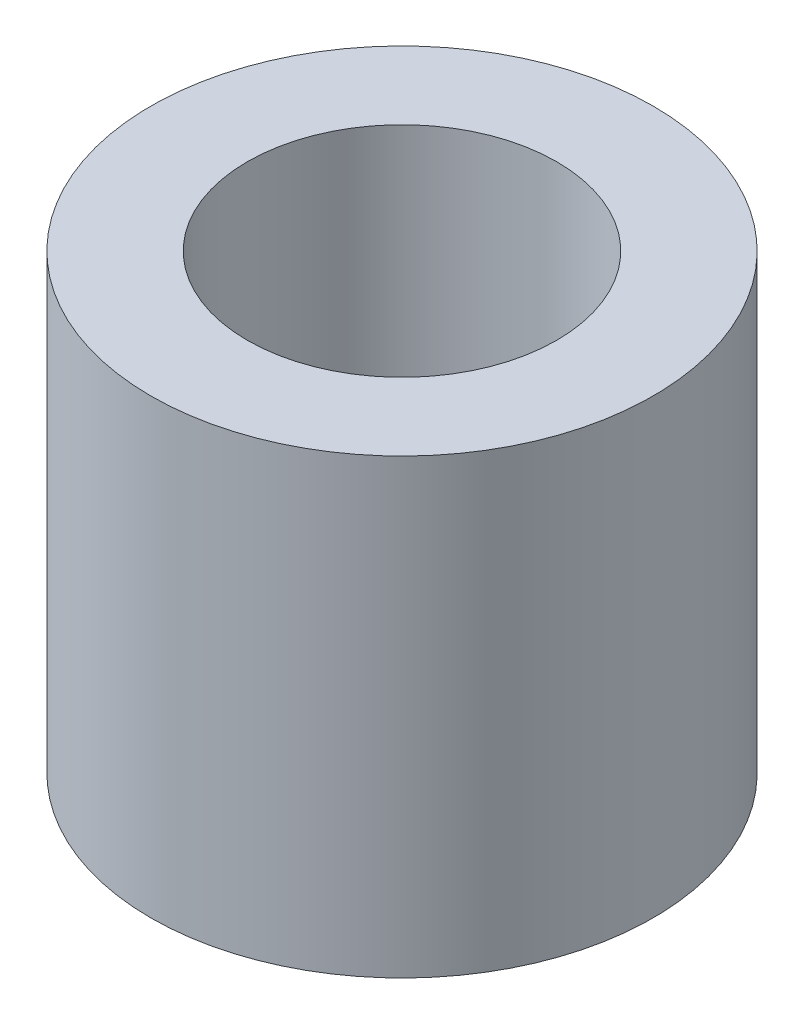
ISO-10303-21;
HEADER;
FILE_DESCRIPTION(('STEP AP214'),'2;1');
FILE_NAME('part.step','',(''),(''),'','','');
FILE_SCHEMA(('AUTOMOTIVE_DESIGN { 1 0 10303 214 1 1 1 1 }'));
ENDSEC;
DATA;
#1=APPLICATION_CONTEXT('core data for automotive mechanical design processes');
#2=APPLICATION_PROTOCOL_DEFINITION('international standard','automotive_design',2000,#1);
#3=PRODUCT_CONTEXT('',#1,'mechanical');
#4=PRODUCT('Part','Part','',(#3));
#5=PRODUCT_RELATED_PRODUCT_CATEGORY('part','',(#4));
#6=PRODUCT_DEFINITION_FORMATION('','',#4);
#7=PRODUCT_DEFINITION_CONTEXT('part definition',#1,'design');
#8=PRODUCT_DEFINITION('design','',#6,#7);
#9=PRODUCT_DEFINITION_SHAPE('','',#8);
#10=(LENGTH_UNIT() NAMED_UNIT(*) SI_UNIT(.MILLI.,.METRE.));
#11=(NAMED_UNIT(*) PLANE_ANGLE_UNIT() SI_UNIT($,.RADIAN.));
#12=(NAMED_UNIT(*) SI_UNIT($,.STERADIAN.) SOLID_ANGLE_UNIT());
#13=UNCERTAINTY_MEASURE_WITH_UNIT(LENGTH_MEASURE(1.E-05),#10,'distance_accuracy_value','');
#14=(GEOMETRIC_REPRESENTATION_CONTEXT(3) GLOBAL_UNCERTAINTY_ASSIGNED_CONTEXT((#13)) GLOBAL_UNIT_ASSIGNED_CONTEXT((#10,
#11,#12)) REPRESENTATION_CONTEXT('',''));
#15=CARTESIAN_POINT('',(0.,0.,0.));
#16=DIRECTION('',(0.,0.,1.));
#17=DIRECTION('',(1.,0.,0.));
#18=AXIS2_PLACEMENT_3D('',#15,#16,#17);
#19=CARTESIAN_POINT('',(0.,7.14375,0.));
#20=DIRECTION('',(0.,1.,0.));
#21=DIRECTION('',(0.,0.,1.));
#22=AXIS2_PLACEMENT_3D('',#19,#20,#21);
#23=PLANE('',#22);
#24=CARTESIAN_POINT('',(0.,7.14375,0.));
#25=DIRECTION('',(0.,1.,0.));
#26=DIRECTION('',(0.,0.,1.));
#27=AXIS2_PLACEMENT_3D('',#24,#25,#26);
#28=CIRCLE('',#27,3.96875);
#29=CARTESIAN_POINT('',(0.,7.14375,3.96875));
#30=VERTEX_POINT('',#29);
#31=EDGE_CURVE('E10',#30,#30,#28,.T.);
#32=ORIENTED_EDGE('',*,*,#31,.T.);
#33=EDGE_LOOP('',(#32));
#34=FACE_BOUND('',#33,.T.);
#35=CARTESIAN_POINT('',(0.,7.14375,0.));
#36=DIRECTION('',(0.,1.,0.));
#37=DIRECTION('',(0.,0.,1.));
#38=AXIS2_PLACEMENT_3D('',#35,#36,#37);
#39=CIRCLE('',#38,2.44475);
#40=CARTESIAN_POINT('',(0.,7.14375,2.44475));
#41=VERTEX_POINT('',#40);
#42=EDGE_CURVE('E43',#41,#41,#39,.T.);
#43=ORIENTED_EDGE('',*,*,#42,.F.);
#44=EDGE_LOOP('',(#43));
#45=FACE_BOUND('',#44,.T.);
#46=ADVANCED_FACE('F32',(#34,#45),#23,.T.);
#47=CARTESIAN_POINT('',(0.,0.,0.));
#48=DIRECTION('',(0.,1.,0.));
#49=DIRECTION('',(0.,0.,1.));
#50=AXIS2_PLACEMENT_3D('',#47,#48,#49);
#51=PLANE('',#50);
#52=CARTESIAN_POINT('',(0.,0.,0.));
#53=DIRECTION('',(0.,1.,0.));
#54=DIRECTION('',(0.,0.,1.));
#55=AXIS2_PLACEMENT_3D('',#52,#53,#54);
#56=CIRCLE('',#55,3.96875);
#57=CARTESIAN_POINT('',(0.,0.,3.96875));
#58=VERTEX_POINT('',#57);
#59=EDGE_CURVE('E36',#58,#58,#56,.T.);
#60=ORIENTED_EDGE('',*,*,#59,.F.);
#61=EDGE_LOOP('',(#60));
#62=FACE_BOUND('',#61,.T.);
#63=CARTESIAN_POINT('',(0.,0.,0.));
#64=DIRECTION('',(0.,1.,0.));
#65=DIRECTION('',(0.,0.,1.));
#66=AXIS2_PLACEMENT_3D('',#63,#64,#65);
#67=CIRCLE('',#66,2.44475);
#68=CARTESIAN_POINT('',(0.,0.,2.44475));
#69=VERTEX_POINT('',#68);
#70=EDGE_CURVE('E45',#69,#69,#67,.T.);
#71=ORIENTED_EDGE('',*,*,#70,.T.);
#72=EDGE_LOOP('',(#71));
#73=FACE_BOUND('',#72,.T.);
#74=ADVANCED_FACE('F55',(#62,#73),#51,.F.);
#75=CARTESIAN_POINT('',(0.,7.14375,0.));
#76=DIRECTION('',(0.,-1.,0.));
#77=DIRECTION('',(0.,0.,-1.));
#78=AXIS2_PLACEMENT_3D('',#75,#76,#77);
#79=CYLINDRICAL_SURFACE('',#78,3.96875);
#80=ORIENTED_EDGE('',*,*,#31,.F.);
#81=EDGE_LOOP('',(#80));
#82=FACE_BOUND('',#81,.T.);
#83=ORIENTED_EDGE('',*,*,#59,.T.);
#84=EDGE_LOOP('',(#83));
#85=FACE_BOUND('',#84,.T.);
#86=ADVANCED_FACE('F34',(#82,#85),#79,.T.);
#87=CARTESIAN_POINT('',(0.,7.14375,0.));
#88=DIRECTION('',(0.,-1.,0.));
#89=DIRECTION('',(0.,0.,-1.));
#90=AXIS2_PLACEMENT_3D('',#87,#88,#89);
#91=CYLINDRICAL_SURFACE('',#90,2.44475);
#92=ORIENTED_EDGE('',*,*,#42,.T.);
#93=EDGE_LOOP('',(#92));
#94=FACE_BOUND('',#93,.T.);
#95=ORIENTED_EDGE('',*,*,#70,.F.);
#96=EDGE_LOOP('',(#95));
#97=FACE_BOUND('',#96,.T.);
#98=ADVANCED_FACE('F51',(#94,#97),#91,.F.);
#99=CLOSED_SHELL('',(#46,#74,#86,#98));
#100=MANIFOLD_SOLID_BREP('B2',#99);
#101=ADVANCED_BREP_SHAPE_REPRESENTATION('',(#18,#100),#14);
#102=SHAPE_DEFINITION_REPRESENTATION(#9,#101);
ENDSEC;
END-ISO-10303-21;
